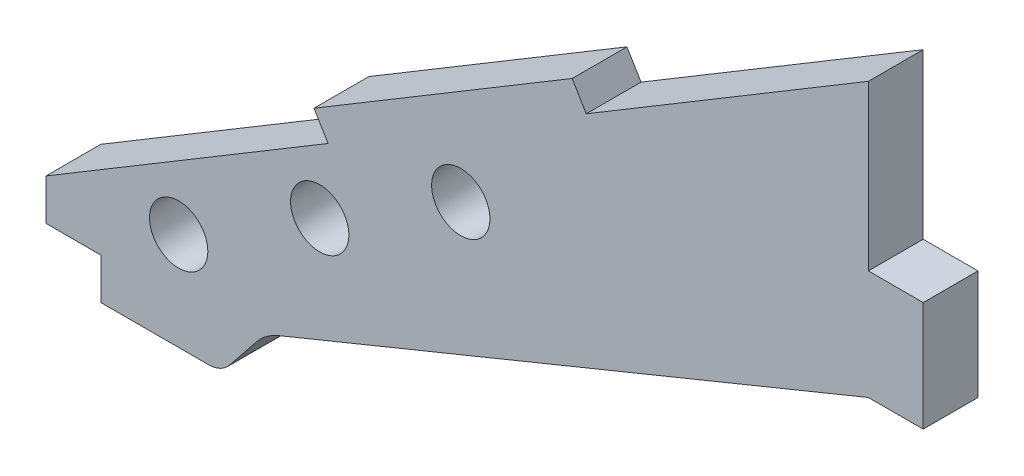
ISO-10303-21;
HEADER;
FILE_DESCRIPTION(('STEP AP214'),'2;1');
FILE_NAME('part.step','',(''),(''),'','','');
FILE_SCHEMA(('AUTOMOTIVE_DESIGN { 1 0 10303 214 1 1 1 1 }'));
ENDSEC;
DATA;
#1=APPLICATION_CONTEXT('core data for automotive mechanical design processes');
#2=APPLICATION_PROTOCOL_DEFINITION('international standard','automotive_design',2000,#1);
#3=PRODUCT_CONTEXT('',#1,'mechanical');
#4=PRODUCT('Part','Part','',(#3));
#5=PRODUCT_RELATED_PRODUCT_CATEGORY('part','',(#4));
#6=PRODUCT_DEFINITION_FORMATION('','',#4);
#7=PRODUCT_DEFINITION_CONTEXT('part definition',#1,'design');
#8=PRODUCT_DEFINITION('design','',#6,#7);
#9=PRODUCT_DEFINITION_SHAPE('','',#8);
#10=(LENGTH_UNIT() NAMED_UNIT(*) SI_UNIT(.MILLI.,.METRE.));
#11=(NAMED_UNIT(*) PLANE_ANGLE_UNIT() SI_UNIT($,.RADIAN.));
#12=(NAMED_UNIT(*) SI_UNIT($,.STERADIAN.) SOLID_ANGLE_UNIT());
#13=UNCERTAINTY_MEASURE_WITH_UNIT(LENGTH_MEASURE(1.E-05),#10,'distance_accuracy_value','');
#14=(GEOMETRIC_REPRESENTATION_CONTEXT(3) GLOBAL_UNCERTAINTY_ASSIGNED_CONTEXT((#13)) GLOBAL_UNIT_ASSIGNED_CONTEXT((#10,
#11,#12)) REPRESENTATION_CONTEXT('',''));
#15=CARTESIAN_POINT('',(0.,0.,0.));
#16=DIRECTION('',(0.,0.,1.));
#17=DIRECTION('',(1.,0.,0.));
#18=AXIS2_PLACEMENT_3D('',#15,#16,#17);
#19=CARTESIAN_POINT('',(-25.1930591569251,42.0112919940912,6.35));
#20=DIRECTION('',(-0.514289859311157,0.857616429768991,0.));
#21=DIRECTION('',(-0.857616429768991,-0.514289859311157,0.));
#22=AXIS2_PLACEMENT_3D('',#19,#20,#21);
#23=PLANE('',#22);
#24=DIRECTION('',(0.,0.,1.));
#25=VECTOR('',#24,1.);
#26=CARTESIAN_POINT('',(-62.5748140258015,19.5944436397551,-37.6940669295478));
#27=LINE('',#26,#25);
#28=CARTESIAN_POINT('',(-62.5748140258015,19.5944436397551,0.));
#29=VERTEX_POINT('',#28);
#30=CARTESIAN_POINT('',(-62.5748140258015,19.5944436397551,6.35));
#31=VERTEX_POINT('',#30);
#32=EDGE_CURVE('E294',#29,#31,#27,.T.);
#33=ORIENTED_EDGE('',*,*,#32,.F.);
#34=DIRECTION('',(0.857616429768991,0.514289859311157,0.));
#35=VECTOR('',#34,1.);
#36=CARTESIAN_POINT('',(-25.1930591569251,42.0112919940912,0.));
#37=LINE('',#36,#35);
#38=CARTESIAN_POINT('',(-95.25,0.,0.));
#39=VERTEX_POINT('',#38);
#40=EDGE_CURVE('E191',#39,#29,#37,.T.);
#41=ORIENTED_EDGE('',*,*,#40,.F.);
#42=DIRECTION('',(0.,0.,-1.));
#43=VECTOR('',#42,1.);
#44=CARTESIAN_POINT('',(-95.25,0.,6.35));
#45=LINE('',#44,#43);
#46=CARTESIAN_POINT('',(-95.25,0.,6.35));
#47=VERTEX_POINT('',#46);
#48=EDGE_CURVE('E188',#47,#39,#45,.T.);
#49=ORIENTED_EDGE('',*,*,#48,.F.);
#50=DIRECTION('',(0.857616429768991,0.514289859311157,0.));
#51=VECTOR('',#50,1.);
#52=CARTESIAN_POINT('',(-25.1930591569251,42.0112919940912,6.35));
#53=LINE('',#52,#51);
#54=EDGE_CURVE('E176',#47,#31,#53,.T.);
#55=ORIENTED_EDGE('',*,*,#54,.T.);
#56=EDGE_LOOP('',(#33,#41,#49,#55));
#57=FACE_BOUND('',#56,.T.);
#58=ADVANCED_FACE('F35',(#57),#23,.T.);
#59=CARTESIAN_POINT('',(0.,0.,6.35));
#60=DIRECTION('',(1.,0.,0.));
#61=DIRECTION('',(0.,1.,0.));
#62=AXIS2_PLACEMENT_3D('',#59,#60,#61);
#63=PLANE('',#62);
#64=DIRECTION('',(0.,0.,1.));
#65=VECTOR('',#64,1.);
#66=CARTESIAN_POINT('',(0.,38.1,-14.1990316571237));
#67=LINE('',#66,#65);
#68=CARTESIAN_POINT('',(0.,38.1,0.));
#69=VERTEX_POINT('',#68);
#70=CARTESIAN_POINT('',(0.,38.1,6.35));
#71=VERTEX_POINT('',#70);
#72=EDGE_CURVE('E201',#69,#71,#67,.T.);
#73=ORIENTED_EDGE('',*,*,#72,.F.);
#74=DIRECTION('',(0.,-1.,0.));
#75=VECTOR('',#74,1.);
#76=CARTESIAN_POINT('',(0.,0.,0.));
#77=LINE('',#76,#75);
#78=CARTESIAN_POINT('',(0.,57.118902342604,0.));
#79=VERTEX_POINT('',#78);
#80=EDGE_CURVE('E194',#79,#69,#77,.T.);
#81=ORIENTED_EDGE('',*,*,#80,.F.);
#82=DIRECTION('',(0.,0.,-1.));
#83=VECTOR('',#82,1.);
#84=CARTESIAN_POINT('',(0.,57.118902342604,6.35));
#85=LINE('',#84,#83);
#86=CARTESIAN_POINT('',(0.,57.118902342604,6.35));
#87=VERTEX_POINT('',#86);
#88=EDGE_CURVE('E319',#87,#79,#85,.T.);
#89=ORIENTED_EDGE('',*,*,#88,.F.);
#90=DIRECTION('',(0.,-1.,0.));
#91=VECTOR('',#90,1.);
#92=CARTESIAN_POINT('',(0.,0.,6.35));
#93=LINE('',#92,#91);
#94=EDGE_CURVE('E175',#87,#71,#93,.T.);
#95=ORIENTED_EDGE('',*,*,#94,.T.);
#96=EDGE_LOOP('',(#73,#81,#89,#95));
#97=FACE_BOUND('',#96,.T.);
#98=ADVANCED_FACE('F323',(#97),#63,.T.);
#99=DIRECTION('',(0.,0.,1.));
#100=VECTOR('',#99,1.);
#101=CARTESIAN_POINT('',(-32.6751859741986,37.5244587028489,-37.6940669295478));
#102=LINE('',#101,#100);
#103=CARTESIAN_POINT('',(-32.6751859741986,37.5244587028489,0.));
#104=VERTEX_POINT('',#103);
#105=CARTESIAN_POINT('',(-32.6751859741986,37.5244587028489,6.35));
#106=VERTEX_POINT('',#105);
#107=EDGE_CURVE('E51',#104,#106,#102,.T.);
#108=ORIENTED_EDGE('',*,*,#107,.T.);
#109=EDGE_CURVE('E167',#106,#87,#53,.T.);
#110=ORIENTED_EDGE('',*,*,#109,.T.);
#111=ORIENTED_EDGE('',*,*,#88,.T.);
#112=EDGE_CURVE('E169',#104,#79,#37,.T.);
#113=ORIENTED_EDGE('',*,*,#112,.F.);
#114=EDGE_LOOP('',(#108,#110,#111,#113));
#115=FACE_BOUND('',#114,.T.);
#116=ADVANCED_FACE('F165',(#115),#23,.T.);
#117=CARTESIAN_POINT('',(-88.9,0.,6.35));
#118=DIRECTION('',(1.,0.,0.));
#119=DIRECTION('',(0.,1.,0.));
#120=AXIS2_PLACEMENT_3D('',#117,#118,#119);
#121=PLANE('',#120);
#122=DIRECTION('',(0.,-1.,0.));
#123=VECTOR('',#122,1.);
#124=CARTESIAN_POINT('',(-88.9,0.,0.));
#125=LINE('',#124,#123);
#126=CARTESIAN_POINT('',(-88.9,-4.7625,0.));
#127=VERTEX_POINT('',#126);
#128=CARTESIAN_POINT('',(-88.9,-9.525,0.));
#129=VERTEX_POINT('',#128);
#130=EDGE_CURVE('E180',#127,#129,#125,.T.);
#131=ORIENTED_EDGE('',*,*,#130,.T.);
#132=DIRECTION('',(0.,0.,1.));
#133=VECTOR('',#132,1.);
#134=CARTESIAN_POINT('',(-88.9,-9.525,-4.99999999997031E-05));
#135=LINE('',#134,#133);
#136=CARTESIAN_POINT('',(-88.9,-9.525,6.35));
#137=VERTEX_POINT('',#136);
#138=EDGE_CURVE('E268',#129,#137,#135,.T.);
#139=ORIENTED_EDGE('',*,*,#138,.T.);
#140=DIRECTION('',(0.,-1.,0.));
#141=VECTOR('',#140,1.);
#142=CARTESIAN_POINT('',(-88.9,0.,6.35));
#143=LINE('',#142,#141);
#144=CARTESIAN_POINT('',(-88.9,-4.7625,6.35));
#145=VERTEX_POINT('',#144);
#146=EDGE_CURVE('E179',#145,#137,#143,.T.);
#147=ORIENTED_EDGE('',*,*,#146,.F.);
#148=DIRECTION('',(0.,0.,1.));
#149=VECTOR('',#148,1.);
#150=CARTESIAN_POINT('',(-88.9,-4.7625,-14.1990316571237));
#151=LINE('',#150,#149);
#152=EDGE_CURVE('E255',#127,#145,#151,.T.);
#153=ORIENTED_EDGE('',*,*,#152,.F.);
#154=EDGE_LOOP('',(#131,#139,#147,#153));
#155=FACE_BOUND('',#154,.T.);
#156=ADVANCED_FACE('F373',(#155),#121,.F.);
#157=CARTESIAN_POINT('',(0.,0.,6.35));
#158=DIRECTION('',(0.,0.,1.));
#159=DIRECTION('',(1.,0.,0.));
#160=AXIS2_PLACEMENT_3D('',#157,#158,#159);
#161=PLANE('',#160);
#162=CARTESIAN_POINT('',(-79.8840986943991,1.81028157432196,6.35));
#163=DIRECTION('',(0.,0.,1.));
#164=DIRECTION('',(1.,0.,0.));
#165=AXIS2_PLACEMENT_3D('',#162,#163,#164);
#166=CIRCLE('',#165,3.37819999999998);
#167=CARTESIAN_POINT('',(-76.5058986943991,1.81028157432196,6.35));
#168=VERTEX_POINT('',#167);
#169=EDGE_CURVE('E285',#168,#168,#166,.T.);
#170=ORIENTED_EDGE('',*,*,#169,.F.);
#171=EDGE_LOOP('',(#170));
#172=FACE_BOUND('',#171,.T.);
#173=CARTESIAN_POINT('',(-63.5465057072999,11.6075033941995,6.35));
#174=DIRECTION('',(0.,0.,1.));
#175=DIRECTION('',(1.,0.,0.));
#176=AXIS2_PLACEMENT_3D('',#173,#174,#175);
#177=CIRCLE('',#176,3.37819999999998);
#178=CARTESIAN_POINT('',(-60.1683057072999,11.6075033941995,6.35));
#179=VERTEX_POINT('',#178);
#180=EDGE_CURVE('E279',#179,#179,#177,.T.);
#181=ORIENTED_EDGE('',*,*,#180,.F.);
#182=EDGE_LOOP('',(#181));
#183=FACE_BOUND('',#182,.T.);
#184=CARTESIAN_POINT('',(-47.2089127202006,21.404725214077,6.35));
#185=DIRECTION('',(0.,0.,1.));
#186=DIRECTION('',(1.,0.,0.));
#187=AXIS2_PLACEMENT_3D('',#184,#185,#186);
#188=CIRCLE('',#187,3.37819999999998);
#189=CARTESIAN_POINT('',(-43.8307127202006,21.404725214077,6.35));
#190=VERTEX_POINT('',#189);
#191=EDGE_CURVE('E276',#190,#190,#188,.T.);
#192=ORIENTED_EDGE('',*,*,#191,.F.);
#193=EDGE_LOOP('',(#192));
#194=FACE_BOUND('',#193,.T.);
#195=DIRECTION('',(-1.,0.,0.));
#196=VECTOR('',#195,1.);
#197=CARTESIAN_POINT('',(-74.93,-9.525,6.35));
#198=LINE('',#197,#196);
#199=CARTESIAN_POINT('',(-76.4559838907699,-9.525,6.35));
#200=VERTEX_POINT('',#199);
#201=EDGE_CURVE('E271',#200,#137,#198,.T.);
#202=ORIENTED_EDGE('',*,*,#201,.F.);
#203=CARTESIAN_POINT('',(-76.4559838907699,-6.35,6.35));
#204=DIRECTION('',(0.,0.,1.));
#205=DIRECTION('',(1.,0.,0.));
#206=AXIS2_PLACEMENT_3D('',#203,#204,#205);
#207=CIRCLE('',#206,3.175);
#208=CARTESIAN_POINT('',(-73.9767254207882,-8.33340677598529,6.35));
#209=VERTEX_POINT('',#208);
#210=EDGE_CURVE('E11',#200,#209,#207,.T.);
#211=ORIENTED_EDGE('',*,*,#210,.T.);
#212=DIRECTION('',(-0.624695047554424,-0.78086880944303,0.));
#213=VECTOR('',#212,1.);
#214=CARTESIAN_POINT('',(-82.55,-19.05,6.35));
#215=LINE('',#214,#213);
#216=CARTESIAN_POINT('',(-70.8792554763156,-4.46156934539444,6.35));
#217=VERTEX_POINT('',#216);
#218=EDGE_CURVE('E226',#217,#209,#215,.T.);
#219=ORIENTED_EDGE('',*,*,#218,.F.);
#220=CARTESIAN_POINT('',(-65.9207385363523,-8.42838289736504,6.35));
#221=DIRECTION('',(0.,0.,1.));
#222=DIRECTION('',(1.,0.,0.));
#223=AXIS2_PLACEMENT_3D('',#220,#221,#222);
#224=CIRCLE('',#223,6.35);
#225=CARTESIAN_POINT('',(-68.3250571066775,-2.55115972545899,6.35));
#226=VERTEX_POINT('',#225);
#227=EDGE_CURVE('E244',#217,#226,#224,.F.);
#228=ORIENTED_EDGE('',*,*,#227,.T.);
#229=DIRECTION('',(-0.925546956205677,-0.378632845720504,0.));
#230=VECTOR('',#229,1.);
#231=CARTESIAN_POINT('',(-69.85,-3.17500000000001,6.35));
#232=LINE('',#231,#230);
#233=CARTESIAN_POINT('',(0.,25.4,6.35));
#234=VERTEX_POINT('',#233);
#235=EDGE_CURVE('E220',#234,#226,#232,.T.);
#236=ORIENTED_EDGE('',*,*,#235,.F.);
#237=DIRECTION('',(1.,0.,0.));
#238=VECTOR('',#237,1.);
#239=CARTESIAN_POINT('',(0.,25.4,6.35));
#240=LINE('',#239,#238);
#241=CARTESIAN_POINT('',(6.35,25.4,6.35));
#242=VERTEX_POINT('',#241);
#243=EDGE_CURVE('E242',#234,#242,#240,.T.);
#244=ORIENTED_EDGE('',*,*,#243,.T.);
#245=DIRECTION('',(0.,1.,0.));
#246=VECTOR('',#245,1.);
#247=CARTESIAN_POINT('',(6.35,25.4,6.35));
#248=LINE('',#247,#246);
#249=CARTESIAN_POINT('',(6.35,38.1,6.35));
#250=VERTEX_POINT('',#249);
#251=EDGE_CURVE('E212',#242,#250,#248,.T.);
#252=ORIENTED_EDGE('',*,*,#251,.T.);
#253=DIRECTION('',(-1.,0.,0.));
#254=VECTOR('',#253,1.);
#255=CARTESIAN_POINT('',(0.,38.1,6.35));
#256=LINE('',#255,#254);
#257=EDGE_CURVE('E207',#250,#71,#256,.T.);
#258=ORIENTED_EDGE('',*,*,#257,.T.);
#259=ORIENTED_EDGE('',*,*,#94,.F.);
#260=ORIENTED_EDGE('',*,*,#109,.F.);
#261=DIRECTION('',(-0.514289859311158,0.85761642976899,0.));
#262=VECTOR('',#261,1.);
#263=CARTESIAN_POINT('',(-32.6751859741986,37.5244587028489,6.35));
#264=LINE('',#263,#262);
#265=CARTESIAN_POINT('',(-34.3080562775115,40.2473908673655,6.35));
#266=VERTEX_POINT('',#265);
#267=EDGE_CURVE('E153',#106,#266,#264,.T.);
#268=ORIENTED_EDGE('',*,*,#267,.T.);
#269=DIRECTION('',(-0.857616429768991,-0.514289859311157,0.));
#270=VECTOR('',#269,1.);
#271=CARTESIAN_POINT('',(-34.3080562775115,40.2473908673655,6.35));
#272=LINE('',#271,#270);
#273=CARTESIAN_POINT('',(-64.2076843291144,22.3173758042716,6.35));
#274=VERTEX_POINT('',#273);
#275=EDGE_CURVE('E161',#266,#274,#272,.T.);
#276=ORIENTED_EDGE('',*,*,#275,.T.);
#277=DIRECTION('',(0.514289859311157,-0.857616429768991,0.));
#278=VECTOR('',#277,1.);
#279=CARTESIAN_POINT('',(-64.2076843291144,22.3173758042716,6.35));
#280=LINE('',#279,#278);
#281=EDGE_CURVE('E170',#274,#31,#280,.T.);
#282=ORIENTED_EDGE('',*,*,#281,.T.);
#283=ORIENTED_EDGE('',*,*,#54,.F.);
#284=DIRECTION('',(0.,-1.,0.));
#285=VECTOR('',#284,1.);
#286=CARTESIAN_POINT('',(-95.25,0.,6.35));
#287=LINE('',#286,#285);
#288=CARTESIAN_POINT('',(-95.25,-4.7625,6.35));
#289=VERTEX_POINT('',#288);
#290=EDGE_CURVE('E261',#47,#289,#287,.T.);
#291=ORIENTED_EDGE('',*,*,#290,.T.);
#292=DIRECTION('',(1.,0.,0.));
#293=VECTOR('',#292,1.);
#294=CARTESIAN_POINT('',(-95.25,-4.7625,6.35));
#295=LINE('',#294,#293);
#296=EDGE_CURVE('E256',#289,#145,#295,.T.);
#297=ORIENTED_EDGE('',*,*,#296,.T.);
#298=ORIENTED_EDGE('',*,*,#146,.T.);
#299=EDGE_LOOP('',(#202,#211,#219,#228,#236,#244,#252,#258,#259,#260,#268,#276,#282,#283,#291,
#297,#298));
#300=FACE_BOUND('',#299,.T.);
#301=ADVANCED_FACE('F173',(#172,#183,#194,#300),#161,.T.);
#302=CARTESIAN_POINT('',(0.,0.,0.));
#303=DIRECTION('',(0.,0.,1.));
#304=DIRECTION('',(1.,0.,0.));
#305=AXIS2_PLACEMENT_3D('',#302,#303,#304);
#306=PLANE('',#305);
#307=CARTESIAN_POINT('',(-79.8840986943991,1.81028157432196,0.));
#308=DIRECTION('',(0.,0.,1.));
#309=DIRECTION('',(1.,0.,0.));
#310=AXIS2_PLACEMENT_3D('',#307,#308,#309);
#311=CIRCLE('',#310,3.37819999999999);
#312=CARTESIAN_POINT('',(-76.5058986943991,1.81028157432196,0.));
#313=VERTEX_POINT('',#312);
#314=EDGE_CURVE('E282',#313,#313,#311,.T.);
#315=ORIENTED_EDGE('',*,*,#314,.T.);
#316=EDGE_LOOP('',(#315));
#317=FACE_BOUND('',#316,.T.);
#318=CARTESIAN_POINT('',(-63.5465057072999,11.6075033941995,0.));
#319=DIRECTION('',(0.,0.,1.));
#320=DIRECTION('',(1.,0.,0.));
#321=AXIS2_PLACEMENT_3D('',#318,#319,#320);
#322=CIRCLE('',#321,3.37819999999999);
#323=CARTESIAN_POINT('',(-60.1683057072999,11.6075033941995,0.));
#324=VERTEX_POINT('',#323);
#325=EDGE_CURVE('E39',#324,#324,#322,.T.);
#326=ORIENTED_EDGE('',*,*,#325,.T.);
#327=EDGE_LOOP('',(#326));
#328=FACE_BOUND('',#327,.T.);
#329=CARTESIAN_POINT('',(-47.2089127202006,21.404725214077,0.));
#330=DIRECTION('',(0.,0.,1.));
#331=DIRECTION('',(1.,0.,0.));
#332=AXIS2_PLACEMENT_3D('',#329,#330,#331);
#333=CIRCLE('',#332,3.37819999999999);
#334=CARTESIAN_POINT('',(-43.8307127202006,21.404725214077,0.));
#335=VERTEX_POINT('',#334);
#336=EDGE_CURVE('E273',#335,#335,#333,.T.);
#337=ORIENTED_EDGE('',*,*,#336,.T.);
#338=EDGE_LOOP('',(#337));
#339=FACE_BOUND('',#338,.T.);
#340=DIRECTION('',(-0.624695047554424,-0.78086880944303,0.));
#341=VECTOR('',#340,1.);
#342=CARTESIAN_POINT('',(-82.55,-19.05,0.));
#343=LINE('',#342,#341);
#344=CARTESIAN_POINT('',(-70.8792554763156,-4.46156934539444,0.));
#345=VERTEX_POINT('',#344);
#346=CARTESIAN_POINT('',(-73.9767254207882,-8.33340677598529,0.));
#347=VERTEX_POINT('',#346);
#348=EDGE_CURVE('E225',#345,#347,#343,.T.);
#349=ORIENTED_EDGE('',*,*,#348,.T.);
#350=CARTESIAN_POINT('',(-76.4559838907699,-6.35,0.));
#351=DIRECTION('',(0.,0.,1.));
#352=DIRECTION('',(1.,0.,0.));
#353=AXIS2_PLACEMENT_3D('',#350,#351,#352);
#354=CIRCLE('',#353,3.175);
#355=CARTESIAN_POINT('',(-76.4559838907699,-9.525,0.));
#356=VERTEX_POINT('',#355);
#357=EDGE_CURVE('E339',#347,#356,#354,.F.);
#358=ORIENTED_EDGE('',*,*,#357,.T.);
#359=DIRECTION('',(-1.,0.,0.));
#360=VECTOR('',#359,1.);
#361=CARTESIAN_POINT('',(0.,-9.52499999999998,0.));
#362=LINE('',#361,#360);
#363=EDGE_CURVE('E264',#356,#129,#362,.T.);
#364=ORIENTED_EDGE('',*,*,#363,.T.);
#365=ORIENTED_EDGE('',*,*,#130,.F.);
#366=DIRECTION('',(-1.,0.,0.));
#367=VECTOR('',#366,1.);
#368=CARTESIAN_POINT('',(-95.25,-4.7625,0.));
#369=LINE('',#368,#367);
#370=CARTESIAN_POINT('',(-95.25,-4.7625,0.));
#371=VERTEX_POINT('',#370);
#372=EDGE_CURVE('E248',#127,#371,#369,.T.);
#373=ORIENTED_EDGE('',*,*,#372,.T.);
#374=DIRECTION('',(0.,1.,0.));
#375=VECTOR('',#374,1.);
#376=CARTESIAN_POINT('',(-95.25,0.,0.));
#377=LINE('',#376,#375);
#378=EDGE_CURVE('E249',#371,#39,#377,.T.);
#379=ORIENTED_EDGE('',*,*,#378,.T.);
#380=ORIENTED_EDGE('',*,*,#40,.T.);
#381=DIRECTION('',(-0.514289859311157,0.857616429768991,0.));
#382=VECTOR('',#381,1.);
#383=CARTESIAN_POINT('',(-64.2076843291144,22.3173758042716,0.));
#384=LINE('',#383,#382);
#385=CARTESIAN_POINT('',(-64.2076843291144,22.3173758042716,0.));
#386=VERTEX_POINT('',#385);
#387=EDGE_CURVE('E289',#29,#386,#384,.T.);
#388=ORIENTED_EDGE('',*,*,#387,.T.);
#389=DIRECTION('',(0.857616429768991,0.514289859311157,0.));
#390=VECTOR('',#389,1.);
#391=CARTESIAN_POINT('',(-34.3080562775115,40.2473908673655,0.));
#392=LINE('',#391,#390);
#393=CARTESIAN_POINT('',(-34.3080562775115,40.2473908673655,0.));
#394=VERTEX_POINT('',#393);
#395=EDGE_CURVE('E296',#386,#394,#392,.T.);
#396=ORIENTED_EDGE('',*,*,#395,.T.);
#397=DIRECTION('',(0.514289859311158,-0.85761642976899,0.));
#398=VECTOR('',#397,1.);
#399=CARTESIAN_POINT('',(-32.6751859741986,37.5244587028489,0.));
#400=LINE('',#399,#398);
#401=EDGE_CURVE('E288',#394,#104,#400,.T.);
#402=ORIENTED_EDGE('',*,*,#401,.T.);
#403=ORIENTED_EDGE('',*,*,#112,.T.);
#404=ORIENTED_EDGE('',*,*,#80,.T.);
#405=DIRECTION('',(1.,0.,0.));
#406=VECTOR('',#405,1.);
#407=CARTESIAN_POINT('',(0.,38.1,0.));
#408=LINE('',#407,#406);
#409=CARTESIAN_POINT('',(6.35,38.1,0.));
#410=VERTEX_POINT('',#409);
#411=EDGE_CURVE('E221',#69,#410,#408,.T.);
#412=ORIENTED_EDGE('',*,*,#411,.T.);
#413=DIRECTION('',(0.,-1.,0.));
#414=VECTOR('',#413,1.);
#415=CARTESIAN_POINT('',(6.35,25.4,0.));
#416=LINE('',#415,#414);
#417=CARTESIAN_POINT('',(6.35,25.4,0.));
#418=VERTEX_POINT('',#417);
#419=EDGE_CURVE('E205',#410,#418,#416,.T.);
#420=ORIENTED_EDGE('',*,*,#419,.T.);
#421=DIRECTION('',(-1.,0.,0.));
#422=VECTOR('',#421,1.);
#423=CARTESIAN_POINT('',(0.,25.4,0.));
#424=LINE('',#423,#422);
#425=CARTESIAN_POINT('',(0.,25.4,0.));
#426=VERTEX_POINT('',#425);
#427=EDGE_CURVE('E217',#418,#426,#424,.T.);
#428=ORIENTED_EDGE('',*,*,#427,.T.);
#429=DIRECTION('',(-0.925546956205677,-0.378632845720504,0.));
#430=VECTOR('',#429,1.);
#431=CARTESIAN_POINT('',(-69.85,-3.17500000000001,0.));
#432=LINE('',#431,#430);
#433=CARTESIAN_POINT('',(-68.3250571066775,-2.55115972545899,0.));
#434=VERTEX_POINT('',#433);
#435=EDGE_CURVE('E222',#426,#434,#432,.T.);
#436=ORIENTED_EDGE('',*,*,#435,.T.);
#437=CARTESIAN_POINT('',(-65.9207385363523,-8.42838289736504,0.));
#438=DIRECTION('',(0.,0.,1.));
#439=DIRECTION('',(1.,0.,0.));
#440=AXIS2_PLACEMENT_3D('',#437,#438,#439);
#441=CIRCLE('',#440,6.35);
#442=EDGE_CURVE('E198',#434,#345,#441,.T.);
#443=ORIENTED_EDGE('',*,*,#442,.T.);
#444=EDGE_LOOP('',(#349,#358,#364,#365,#373,#379,#380,#388,#396,#402,#403,#404,#412,#420,#428,
#436,#443));
#445=FACE_BOUND('',#444,.T.);
#446=ADVANCED_FACE('F303',(#317,#328,#339,#445),#306,.F.);
#447=CARTESIAN_POINT('',(-82.55,-19.05,0.));
#448=DIRECTION('',(-0.78086880944303,0.624695047554424,0.));
#449=DIRECTION('',(-0.624695047554424,-0.78086880944303,0.));
#450=AXIS2_PLACEMENT_3D('',#447,#448,#449);
#451=PLANE('',#450);
#452=ORIENTED_EDGE('',*,*,#218,.T.);
#453=DIRECTION('',(0.,0.,-1.));
#454=VECTOR('',#453,1.);
#455=CARTESIAN_POINT('',(-73.9767254207882,-8.33340677598529,0.));
#456=LINE('',#455,#454);
#457=EDGE_CURVE('E336',#209,#347,#456,.T.);
#458=ORIENTED_EDGE('',*,*,#457,.T.);
#459=ORIENTED_EDGE('',*,*,#348,.F.);
#460=DIRECTION('',(0.,0.,1.));
#461=VECTOR('',#460,1.);
#462=CARTESIAN_POINT('',(-70.8792554763156,-4.46156934539445,6.35));
#463=LINE('',#462,#461);
#464=EDGE_CURVE('E321',#345,#217,#463,.T.);
#465=ORIENTED_EDGE('',*,*,#464,.T.);
#466=EDGE_LOOP('',(#452,#458,#459,#465));
#467=FACE_BOUND('',#466,.T.);
#468=ADVANCED_FACE('F349',(#467),#451,.F.);
#469=CARTESIAN_POINT('',(-69.85,-3.17500000000001,0.));
#470=DIRECTION('',(-0.378632845720504,0.925546956205677,0.));
#471=DIRECTION('',(-0.925546956205677,-0.378632845720504,0.));
#472=AXIS2_PLACEMENT_3D('',#469,#470,#471);
#473=PLANE('',#472);
#474=ORIENTED_EDGE('',*,*,#235,.T.);
#475=DIRECTION('',(0.,0.,1.));
#476=VECTOR('',#475,1.);
#477=CARTESIAN_POINT('',(-68.3250571066775,-2.55115972545899,0.));
#478=LINE('',#477,#476);
#479=EDGE_CURVE('E353',#226,#434,#478,.F.);
#480=ORIENTED_EDGE('',*,*,#479,.T.);
#481=ORIENTED_EDGE('',*,*,#435,.F.);
#482=DIRECTION('',(0.,0.,1.));
#483=VECTOR('',#482,1.);
#484=CARTESIAN_POINT('',(0.,25.4,0.));
#485=LINE('',#484,#483);
#486=EDGE_CURVE('E197',#426,#234,#485,.T.);
#487=ORIENTED_EDGE('',*,*,#486,.T.);
#488=EDGE_LOOP('',(#474,#480,#481,#487));
#489=FACE_BOUND('',#488,.T.);
#490=ADVANCED_FACE('F235',(#489),#473,.F.);
#491=CARTESIAN_POINT('',(-65.9207385363523,-8.42838289736504,0.));
#492=DIRECTION('',(0.,0.,-1.));
#493=DIRECTION('',(-1.,0.,0.));
#494=AXIS2_PLACEMENT_3D('',#491,#492,#493);
#495=CYLINDRICAL_SURFACE('',#494,6.35);
#496=ORIENTED_EDGE('',*,*,#442,.F.);
#497=ORIENTED_EDGE('',*,*,#479,.F.);
#498=ORIENTED_EDGE('',*,*,#227,.F.);
#499=ORIENTED_EDGE('',*,*,#464,.F.);
#500=EDGE_LOOP('',(#496,#497,#498,#499));
#501=FACE_BOUND('',#500,.T.);
#502=ADVANCED_FACE('F357',(#501),#495,.F.);
#503=CARTESIAN_POINT('',(0.,38.1,-14.1990316571237));
#504=DIRECTION('',(0.,1.,0.));
#505=DIRECTION('',(0.,0.,1.));
#506=AXIS2_PLACEMENT_3D('',#503,#504,#505);
#507=PLANE('',#506);
#508=ORIENTED_EDGE('',*,*,#411,.F.);
#509=ORIENTED_EDGE('',*,*,#72,.T.);
#510=ORIENTED_EDGE('',*,*,#257,.F.);
#511=DIRECTION('',(0.,0.,1.));
#512=VECTOR('',#511,1.);
#513=CARTESIAN_POINT('',(6.35,38.1,-14.1990316571237));
#514=LINE('',#513,#512);
#515=EDGE_CURVE('E206',#410,#250,#514,.T.);
#516=ORIENTED_EDGE('',*,*,#515,.F.);
#517=EDGE_LOOP('',(#508,#509,#510,#516));
#518=FACE_BOUND('',#517,.T.);
#519=ADVANCED_FACE('F326',(#518),#507,.T.);
#520=CARTESIAN_POINT('',(6.35,25.4,-14.1990316571237));
#521=DIRECTION('',(1.,0.,0.));
#522=DIRECTION('',(0.,0.,-1.));
#523=AXIS2_PLACEMENT_3D('',#520,#521,#522);
#524=PLANE('',#523);
#525=ORIENTED_EDGE('',*,*,#419,.F.);
#526=ORIENTED_EDGE('',*,*,#515,.T.);
#527=ORIENTED_EDGE('',*,*,#251,.F.);
#528=DIRECTION('',(0.,0.,1.));
#529=VECTOR('',#528,1.);
#530=CARTESIAN_POINT('',(6.35,25.4,-14.1990316571237));
#531=LINE('',#530,#529);
#532=EDGE_CURVE('E215',#418,#242,#531,.T.);
#533=ORIENTED_EDGE('',*,*,#532,.F.);
#534=EDGE_LOOP('',(#525,#526,#527,#533));
#535=FACE_BOUND('',#534,.T.);
#536=ADVANCED_FACE('F330',(#535),#524,.T.);
#537=CARTESIAN_POINT('',(0.,25.4,-14.1990316571237));
#538=DIRECTION('',(0.,-1.,0.));
#539=DIRECTION('',(0.,0.,-1.));
#540=AXIS2_PLACEMENT_3D('',#537,#538,#539);
#541=PLANE('',#540);
#542=ORIENTED_EDGE('',*,*,#427,.F.);
#543=ORIENTED_EDGE('',*,*,#532,.T.);
#544=ORIENTED_EDGE('',*,*,#243,.F.);
#545=ORIENTED_EDGE('',*,*,#486,.F.);
#546=EDGE_LOOP('',(#542,#543,#544,#545));
#547=FACE_BOUND('',#546,.T.);
#548=ADVANCED_FACE('F245',(#547),#541,.T.);
#549=CARTESIAN_POINT('',(-95.25,0.,-14.1990316571237));
#550=DIRECTION('',(-1.,0.,0.));
#551=DIRECTION('',(0.,0.,1.));
#552=AXIS2_PLACEMENT_3D('',#549,#550,#551);
#553=PLANE('',#552);
#554=ORIENTED_EDGE('',*,*,#378,.F.);
#555=DIRECTION('',(0.,0.,1.));
#556=VECTOR('',#555,1.);
#557=CARTESIAN_POINT('',(-95.25,-4.7625,-14.1990316571237));
#558=LINE('',#557,#556);
#559=EDGE_CURVE('E253',#371,#289,#558,.T.);
#560=ORIENTED_EDGE('',*,*,#559,.T.);
#561=ORIENTED_EDGE('',*,*,#290,.F.);
#562=ORIENTED_EDGE('',*,*,#48,.T.);
#563=EDGE_LOOP('',(#554,#560,#561,#562));
#564=FACE_BOUND('',#563,.T.);
#565=ADVANCED_FACE('F391',(#564),#553,.T.);
#566=CARTESIAN_POINT('',(-95.25,-4.7625,-14.1990316571237));
#567=DIRECTION('',(0.,-1.,0.));
#568=DIRECTION('',(0.,0.,-1.));
#569=AXIS2_PLACEMENT_3D('',#566,#567,#568);
#570=PLANE('',#569);
#571=ORIENTED_EDGE('',*,*,#372,.F.);
#572=ORIENTED_EDGE('',*,*,#152,.T.);
#573=ORIENTED_EDGE('',*,*,#296,.F.);
#574=ORIENTED_EDGE('',*,*,#559,.F.);
#575=EDGE_LOOP('',(#571,#572,#573,#574));
#576=FACE_BOUND('',#575,.T.);
#577=ADVANCED_FACE('F396',(#576),#570,.T.);
#578=CARTESIAN_POINT('',(-74.93,-9.525,-4.99999999997031E-05));
#579=DIRECTION('',(0.,1.,0.));
#580=DIRECTION('',(-1.,0.,0.));
#581=AXIS2_PLACEMENT_3D('',#578,#579,#580);
#582=PLANE('',#581);
#583=ORIENTED_EDGE('',*,*,#363,.F.);
#584=DIRECTION('',(0.,0.,-1.));
#585=VECTOR('',#584,1.);
#586=CARTESIAN_POINT('',(-76.4559838907699,-9.525,-4.99999999997031E-05));
#587=LINE('',#586,#585);
#588=EDGE_CURVE('E44',#356,#200,#587,.F.);
#589=ORIENTED_EDGE('',*,*,#588,.T.);
#590=ORIENTED_EDGE('',*,*,#201,.T.);
#591=ORIENTED_EDGE('',*,*,#138,.F.);
#592=EDGE_LOOP('',(#583,#589,#590,#591));
#593=FACE_BOUND('',#592,.T.);
#594=ADVANCED_FACE('F345',(#593),#582,.F.);
#595=CARTESIAN_POINT('',(-76.4559838907699,-6.35,0.));
#596=DIRECTION('',(0.,0.,-1.));
#597=DIRECTION('',(-1.,0.,0.));
#598=AXIS2_PLACEMENT_3D('',#595,#596,#597);
#599=CYLINDRICAL_SURFACE('',#598,3.175);
#600=ORIENTED_EDGE('',*,*,#210,.F.);
#601=ORIENTED_EDGE('',*,*,#588,.F.);
#602=ORIENTED_EDGE('',*,*,#357,.F.);
#603=ORIENTED_EDGE('',*,*,#457,.F.);
#604=EDGE_LOOP('',(#600,#601,#602,#603));
#605=FACE_BOUND('',#604,.T.);
#606=ADVANCED_FACE('F37',(#605),#599,.T.);
#607=CARTESIAN_POINT('',(-47.2089127202006,21.404725214077,6.35));
#608=DIRECTION('',(0.,0.,1.));
#609=DIRECTION('',(1.,0.,0.));
#610=AXIS2_PLACEMENT_3D('',#607,#608,#609);
#611=CYLINDRICAL_SURFACE('',#610,3.37819999999999);
#612=ORIENTED_EDGE('',*,*,#191,.T.);
#613=EDGE_LOOP('',(#612));
#614=FACE_BOUND('',#613,.T.);
#615=ORIENTED_EDGE('',*,*,#336,.F.);
#616=EDGE_LOOP('',(#615));
#617=FACE_BOUND('',#616,.T.);
#618=ADVANCED_FACE('F403',(#614,#617),#611,.F.);
#619=CARTESIAN_POINT('',(-63.5465057072999,11.6075033941995,6.35));
#620=DIRECTION('',(0.,0.,1.));
#621=DIRECTION('',(1.,0.,0.));
#622=AXIS2_PLACEMENT_3D('',#619,#620,#621);
#623=CYLINDRICAL_SURFACE('',#622,3.37819999999999);
#624=ORIENTED_EDGE('',*,*,#180,.T.);
#625=EDGE_LOOP('',(#624));
#626=FACE_BOUND('',#625,.T.);
#627=ORIENTED_EDGE('',*,*,#325,.F.);
#628=EDGE_LOOP('',(#627));
#629=FACE_BOUND('',#628,.T.);
#630=ADVANCED_FACE('F406',(#626,#629),#623,.F.);
#631=CARTESIAN_POINT('',(-79.8840986943991,1.81028157432196,6.35));
#632=DIRECTION('',(0.,0.,1.));
#633=DIRECTION('',(1.,0.,0.));
#634=AXIS2_PLACEMENT_3D('',#631,#632,#633);
#635=CYLINDRICAL_SURFACE('',#634,3.37819999999999);
#636=ORIENTED_EDGE('',*,*,#169,.T.);
#637=EDGE_LOOP('',(#636));
#638=FACE_BOUND('',#637,.T.);
#639=ORIENTED_EDGE('',*,*,#314,.F.);
#640=EDGE_LOOP('',(#639));
#641=FACE_BOUND('',#640,.T.);
#642=ADVANCED_FACE('F410',(#638,#641),#635,.F.);
#643=CARTESIAN_POINT('',(-64.2076843291144,22.3173758042716,-37.6940669295478));
#644=DIRECTION('',(-0.857616429768991,-0.514289859311157,0.));
#645=DIRECTION('',(0.514289859311157,-0.857616429768991,0.));
#646=AXIS2_PLACEMENT_3D('',#643,#644,#645);
#647=PLANE('',#646);
#648=ORIENTED_EDGE('',*,*,#387,.F.);
#649=ORIENTED_EDGE('',*,*,#32,.T.);
#650=ORIENTED_EDGE('',*,*,#281,.F.);
#651=DIRECTION('',(0.,0.,1.));
#652=VECTOR('',#651,1.);
#653=CARTESIAN_POINT('',(-64.2076843291144,22.3173758042716,-37.6940669295478));
#654=LINE('',#653,#652);
#655=EDGE_CURVE('E292',#386,#274,#654,.T.);
#656=ORIENTED_EDGE('',*,*,#655,.F.);
#657=EDGE_LOOP('',(#648,#649,#650,#656));
#658=FACE_BOUND('',#657,.T.);
#659=ADVANCED_FACE('F311',(#658),#647,.T.);
#660=CARTESIAN_POINT('',(-34.3080562775115,40.2473908673655,-37.6940669295478));
#661=DIRECTION('',(-0.514289859311157,0.857616429768991,0.));
#662=DIRECTION('',(-0.857616429768991,-0.514289859311157,0.));
#663=AXIS2_PLACEMENT_3D('',#660,#661,#662);
#664=PLANE('',#663);
#665=ORIENTED_EDGE('',*,*,#395,.F.);
#666=ORIENTED_EDGE('',*,*,#655,.T.);
#667=ORIENTED_EDGE('',*,*,#275,.F.);
#668=DIRECTION('',(0.,0.,1.));
#669=VECTOR('',#668,1.);
#670=CARTESIAN_POINT('',(-34.3080562775115,40.2473908673655,-37.6940669295478));
#671=LINE('',#670,#669);
#672=EDGE_CURVE('E156',#394,#266,#671,.T.);
#673=ORIENTED_EDGE('',*,*,#672,.F.);
#674=EDGE_LOOP('',(#665,#666,#667,#673));
#675=FACE_BOUND('',#674,.T.);
#676=ADVANCED_FACE('F307',(#675),#664,.T.);
#677=CARTESIAN_POINT('',(-32.6751859741986,37.5244587028489,-37.6940669295478));
#678=DIRECTION('',(0.85761642976899,0.514289859311158,0.));
#679=DIRECTION('',(-0.514289859311158,0.85761642976899,0.));
#680=AXIS2_PLACEMENT_3D('',#677,#678,#679);
#681=PLANE('',#680);
#682=ORIENTED_EDGE('',*,*,#401,.F.);
#683=ORIENTED_EDGE('',*,*,#672,.T.);
#684=ORIENTED_EDGE('',*,*,#267,.F.);
#685=ORIENTED_EDGE('',*,*,#107,.F.);
#686=EDGE_LOOP('',(#682,#683,#684,#685));
#687=FACE_BOUND('',#686,.T.);
#688=ADVANCED_FACE('F154',(#687),#681,.T.);
#689=CLOSED_SHELL('',(#58,#98,#116,#156,#301,#446,#468,#490,#502,#519,#536,#548,#565,#577,#594,
#606,#618,#630,#642,#659,#676,#688));
#690=MANIFOLD_SOLID_BREP('B2',#689);
#691=ADVANCED_BREP_SHAPE_REPRESENTATION('',(#18,#690),#14);
#692=SHAPE_DEFINITION_REPRESENTATION(#9,#691);
ENDSEC;
END-ISO-10303-21;
